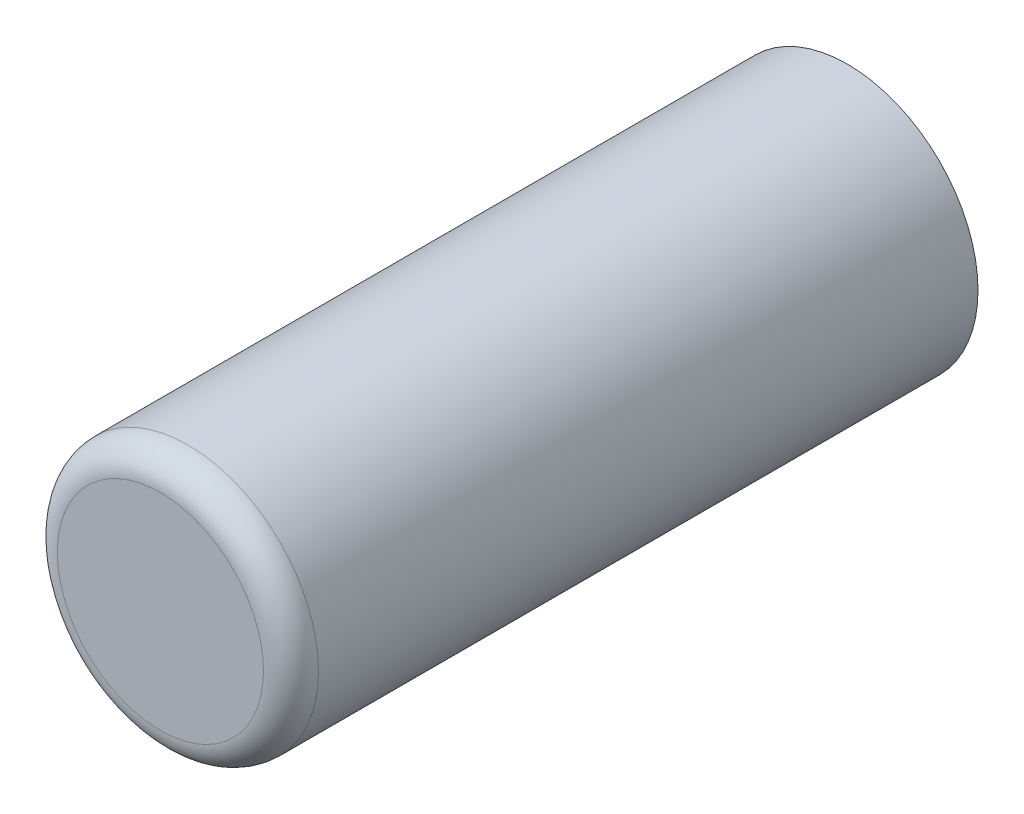
ISO-10303-21;
HEADER;
FILE_DESCRIPTION(('STEP AP214'),'2;1');
FILE_NAME('part.step','',(''),(''),'','','');
FILE_SCHEMA(('AUTOMOTIVE_DESIGN { 1 0 10303 214 1 1 1 1 }'));
ENDSEC;
DATA;
#1=APPLICATION_CONTEXT('core data for automotive mechanical design processes');
#2=APPLICATION_PROTOCOL_DEFINITION('international standard','automotive_design',2000,#1);
#3=PRODUCT_CONTEXT('',#1,'mechanical');
#4=PRODUCT('Part','Part','',(#3));
#5=PRODUCT_RELATED_PRODUCT_CATEGORY('part','',(#4));
#6=PRODUCT_DEFINITION_FORMATION('','',#4);
#7=PRODUCT_DEFINITION_CONTEXT('part definition',#1,'design');
#8=PRODUCT_DEFINITION('design','',#6,#7);
#9=PRODUCT_DEFINITION_SHAPE('','',#8);
#10=(LENGTH_UNIT() NAMED_UNIT(*) SI_UNIT(.MILLI.,.METRE.));
#11=(NAMED_UNIT(*) PLANE_ANGLE_UNIT() SI_UNIT($,.RADIAN.));
#12=(NAMED_UNIT(*) SI_UNIT($,.STERADIAN.) SOLID_ANGLE_UNIT());
#13=UNCERTAINTY_MEASURE_WITH_UNIT(LENGTH_MEASURE(1.E-05),#10,'distance_accuracy_value','');
#14=(GEOMETRIC_REPRESENTATION_CONTEXT(3) GLOBAL_UNCERTAINTY_ASSIGNED_CONTEXT((#13)) GLOBAL_UNIT_ASSIGNED_CONTEXT((#10,
#11,#12)) REPRESENTATION_CONTEXT('',''));
#15=CARTESIAN_POINT('',(0.,0.,0.));
#16=DIRECTION('',(0.,0.,1.));
#17=DIRECTION('',(1.,0.,0.));
#18=AXIS2_PLACEMENT_3D('',#15,#16,#17);
#19=CARTESIAN_POINT('',(0.,0.,10.));
#20=DIRECTION('',(0.,0.,-1.));
#21=DIRECTION('',(-1.,0.,0.));
#22=AXIS2_PLACEMENT_3D('',#19,#20,#21);
#23=CYLINDRICAL_SURFACE('',#22,3.8);
#24=CARTESIAN_POINT('',(0.,0.,9.2));
#25=DIRECTION('',(0.,0.,1.));
#26=DIRECTION('',(1.,0.,0.));
#27=AXIS2_PLACEMENT_3D('',#24,#25,#26);
#28=CIRCLE('',#27,3.8);
#29=CARTESIAN_POINT('',(3.8,0.,9.2));
#30=VERTEX_POINT('',#29);
#31=EDGE_CURVE('E10',#30,#30,#28,.F.);
#32=ORIENTED_EDGE('',*,*,#31,.T.);
#33=EDGE_LOOP('',(#32));
#34=FACE_BOUND('',#33,.T.);
#35=CARTESIAN_POINT('',(0.,0.,-10.));
#36=DIRECTION('',(0.,0.,1.));
#37=DIRECTION('',(1.,0.,0.));
#38=AXIS2_PLACEMENT_3D('',#35,#36,#37);
#39=CIRCLE('',#38,3.8);
#40=CARTESIAN_POINT('',(3.8,0.,-10.));
#41=VERTEX_POINT('',#40);
#42=EDGE_CURVE('E45',#41,#41,#39,.T.);
#43=ORIENTED_EDGE('',*,*,#42,.T.);
#44=EDGE_LOOP('',(#43));
#45=FACE_BOUND('',#44,.T.);
#46=ADVANCED_FACE('F34',(#34,#45),#23,.T.);
#47=CARTESIAN_POINT('',(0.,0.,10.));
#48=DIRECTION('',(0.,0.,1.));
#49=DIRECTION('',(1.,0.,0.));
#50=AXIS2_PLACEMENT_3D('',#47,#48,#49);
#51=PLANE('',#50);
#52=CARTESIAN_POINT('',(0.,0.,10.));
#53=DIRECTION('',(0.,0.,1.));
#54=DIRECTION('',(1.,0.,0.));
#55=AXIS2_PLACEMENT_3D('',#52,#53,#54);
#56=CIRCLE('',#55,3.);
#57=CARTESIAN_POINT('',(3.,0.,10.));
#58=VERTEX_POINT('',#57);
#59=EDGE_CURVE('E41',#58,#58,#56,.T.);
#60=ORIENTED_EDGE('',*,*,#59,.T.);
#61=EDGE_LOOP('',(#60));
#62=FACE_BOUND('',#61,.T.);
#63=ADVANCED_FACE('F55',(#62),#51,.T.);
#64=CARTESIAN_POINT('',(0.,0.,-10.));
#65=DIRECTION('',(0.,0.,1.));
#66=DIRECTION('',(1.,0.,0.));
#67=AXIS2_PLACEMENT_3D('',#64,#65,#66);
#68=PLANE('',#67);
#69=ORIENTED_EDGE('',*,*,#42,.F.);
#70=EDGE_LOOP('',(#69));
#71=FACE_BOUND('',#70,.T.);
#72=ADVANCED_FACE('F53',(#71),#68,.F.);
#73=CARTESIAN_POINT('',(0.,0.,9.2));
#74=DIRECTION('',(0.,0.,1.));
#75=DIRECTION('',(1.,0.,0.));
#76=AXIS2_PLACEMENT_3D('',#73,#74,#75);
#77=TOROIDAL_SURFACE('',#76,3.,0.8);
#78=ORIENTED_EDGE('',*,*,#31,.F.);
#79=EDGE_LOOP('',(#78));
#80=FACE_BOUND('',#79,.T.);
#81=ORIENTED_EDGE('',*,*,#59,.F.);
#82=EDGE_LOOP('',(#81));
#83=FACE_BOUND('',#82,.T.);
#84=ADVANCED_FACE('F36',(#80,#83),#77,.T.);
#85=CLOSED_SHELL('',(#46,#63,#72,#84));
#86=MANIFOLD_SOLID_BREP('B2',#85);
#87=ADVANCED_BREP_SHAPE_REPRESENTATION('',(#18,#86),#14);
#88=SHAPE_DEFINITION_REPRESENTATION(#9,#87);
ENDSEC;
END-ISO-10303-21;
